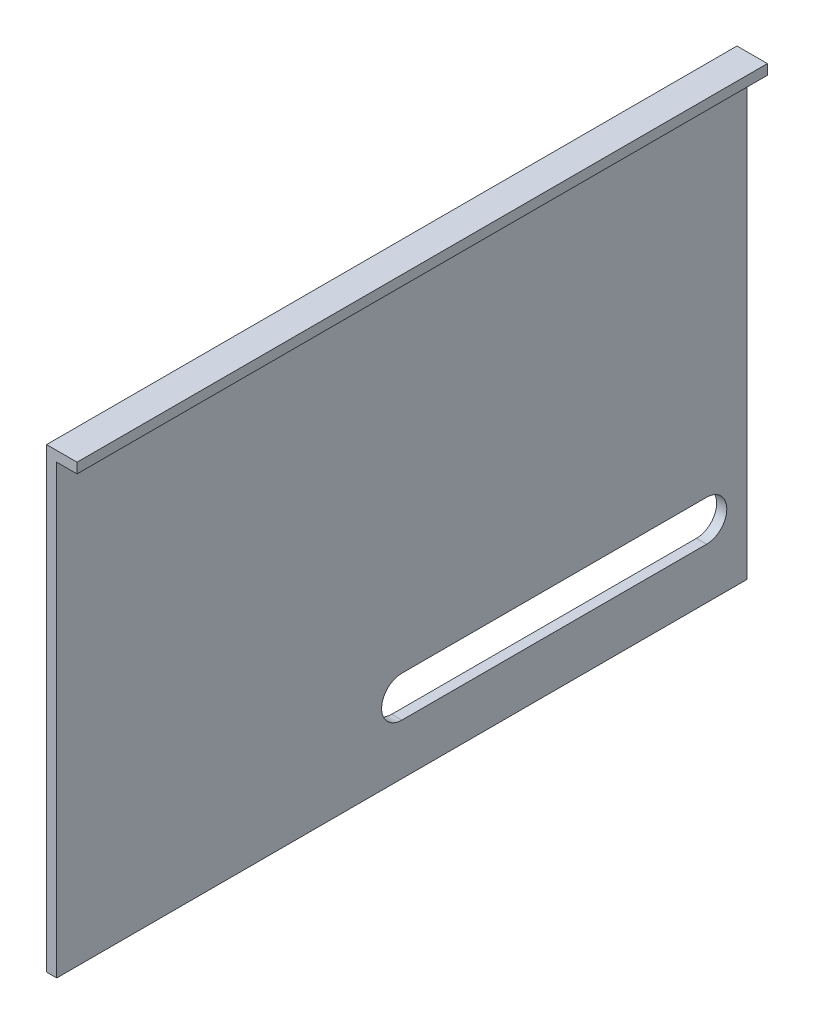
ISO-10303-21;
HEADER;
FILE_DESCRIPTION(('STEP AP214'),'2;1');
FILE_NAME('part.step','',(''),(''),'','','');
FILE_SCHEMA(('AUTOMOTIVE_DESIGN { 1 0 10303 214 1 1 1 1 }'));
ENDSEC;
DATA;
#1=APPLICATION_CONTEXT('core data for automotive mechanical design processes');
#2=APPLICATION_PROTOCOL_DEFINITION('international standard','automotive_design',2000,#1);
#3=PRODUCT_CONTEXT('',#1,'mechanical');
#4=PRODUCT('Part','Part','',(#3));
#5=PRODUCT_RELATED_PRODUCT_CATEGORY('part','',(#4));
#6=PRODUCT_DEFINITION_FORMATION('','',#4);
#7=PRODUCT_DEFINITION_CONTEXT('part definition',#1,'design');
#8=PRODUCT_DEFINITION('design','',#6,#7);
#9=PRODUCT_DEFINITION_SHAPE('','',#8);
#10=(LENGTH_UNIT() NAMED_UNIT(*) SI_UNIT(.MILLI.,.METRE.));
#11=(NAMED_UNIT(*) PLANE_ANGLE_UNIT() SI_UNIT($,.RADIAN.));
#12=(NAMED_UNIT(*) SI_UNIT($,.STERADIAN.) SOLID_ANGLE_UNIT());
#13=UNCERTAINTY_MEASURE_WITH_UNIT(LENGTH_MEASURE(1.E-05),#10,'distance_accuracy_value','');
#14=(GEOMETRIC_REPRESENTATION_CONTEXT(3) GLOBAL_UNCERTAINTY_ASSIGNED_CONTEXT((#13)) GLOBAL_UNIT_ASSIGNED_CONTEXT((#10,
#11,#12)) REPRESENTATION_CONTEXT('',''));
#15=CARTESIAN_POINT('',(0.,0.,0.));
#16=DIRECTION('',(0.,0.,1.));
#17=DIRECTION('',(1.,0.,0.));
#18=AXIS2_PLACEMENT_3D('',#15,#16,#17);
#19=CARTESIAN_POINT('',(6.35,142.875,215.9));
#20=DIRECTION('',(0.,0.,-1.));
#21=DIRECTION('',(-1.,0.,0.));
#22=AXIS2_PLACEMENT_3D('',#19,#20,#21);
#23=PLANE('',#22);
#24=DIRECTION('',(0.,-1.,0.));
#25=VECTOR('',#24,1.);
#26=CARTESIAN_POINT('',(0.,142.875,215.9));
#27=LINE('',#26,#25);
#28=CARTESIAN_POINT('',(0.,142.875,215.9));
#29=VERTEX_POINT('',#28);
#30=CARTESIAN_POINT('',(0.,-142.875,215.9));
#31=VERTEX_POINT('',#30);
#32=EDGE_CURVE('E168',#29,#31,#27,.T.);
#33=ORIENTED_EDGE('',*,*,#32,.T.);
#34=DIRECTION('',(-1.,0.,0.));
#35=VECTOR('',#34,1.);
#36=CARTESIAN_POINT('',(6.35,-142.875,215.9));
#37=LINE('',#36,#35);
#38=CARTESIAN_POINT('',(6.35,-142.875,215.9));
#39=VERTEX_POINT('',#38);
#40=EDGE_CURVE('E11',#39,#31,#37,.T.);
#41=ORIENTED_EDGE('',*,*,#40,.F.);
#42=DIRECTION('',(0.,-1.,0.));
#43=VECTOR('',#42,1.);
#44=CARTESIAN_POINT('',(6.35,142.875,215.9));
#45=LINE('',#44,#43);
#46=CARTESIAN_POINT('',(6.35,136.525,215.9));
#47=VERTEX_POINT('',#46);
#48=EDGE_CURVE('E169',#47,#39,#45,.T.);
#49=ORIENTED_EDGE('',*,*,#48,.F.);
#50=DIRECTION('',(-1.,0.,0.));
#51=VECTOR('',#50,1.);
#52=CARTESIAN_POINT('',(19.05,136.525,215.9));
#53=LINE('',#52,#51);
#54=CARTESIAN_POINT('',(19.05,136.525,215.9));
#55=VERTEX_POINT('',#54);
#56=EDGE_CURVE('E165',#55,#47,#53,.T.);
#57=ORIENTED_EDGE('',*,*,#56,.F.);
#58=DIRECTION('',(0.,-1.,0.));
#59=VECTOR('',#58,1.);
#60=CARTESIAN_POINT('',(19.05,142.875,215.9));
#61=LINE('',#60,#59);
#62=CARTESIAN_POINT('',(19.05,142.875,215.9));
#63=VERTEX_POINT('',#62);
#64=EDGE_CURVE('E149',#63,#55,#61,.T.);
#65=ORIENTED_EDGE('',*,*,#64,.F.);
#66=DIRECTION('',(-1.,0.,0.));
#67=VECTOR('',#66,1.);
#68=CARTESIAN_POINT('',(6.35,142.875,215.9));
#69=LINE('',#68,#67);
#70=EDGE_CURVE('E176',#63,#29,#69,.T.);
#71=ORIENTED_EDGE('',*,*,#70,.T.);
#72=EDGE_LOOP('',(#33,#41,#49,#57,#65,#71));
#73=FACE_BOUND('',#72,.T.);
#74=ADVANCED_FACE('F37',(#73),#23,.F.);
#75=CARTESIAN_POINT('',(6.35,-142.875,215.9));
#76=DIRECTION('',(0.,1.,0.));
#77=DIRECTION('',(0.,0.,1.));
#78=AXIS2_PLACEMENT_3D('',#75,#76,#77);
#79=PLANE('',#78);
#80=DIRECTION('',(0.,0.,-1.));
#81=VECTOR('',#80,1.);
#82=CARTESIAN_POINT('',(0.,-142.875,215.9));
#83=LINE('',#82,#81);
#84=CARTESIAN_POINT('',(0.,-142.875,-215.9));
#85=VERTEX_POINT('',#84);
#86=EDGE_CURVE('E179',#31,#85,#83,.T.);
#87=ORIENTED_EDGE('',*,*,#86,.T.);
#88=DIRECTION('',(-1.,0.,0.));
#89=VECTOR('',#88,1.);
#90=CARTESIAN_POINT('',(6.35,-142.875,-215.9));
#91=LINE('',#90,#89);
#92=CARTESIAN_POINT('',(6.35,-142.875,-215.9));
#93=VERTEX_POINT('',#92);
#94=EDGE_CURVE('E44',#93,#85,#91,.T.);
#95=ORIENTED_EDGE('',*,*,#94,.F.);
#96=DIRECTION('',(0.,0.,-1.));
#97=VECTOR('',#96,1.);
#98=CARTESIAN_POINT('',(6.35,-142.875,215.9));
#99=LINE('',#98,#97);
#100=EDGE_CURVE('E171',#39,#93,#99,.T.);
#101=ORIENTED_EDGE('',*,*,#100,.F.);
#102=ORIENTED_EDGE('',*,*,#40,.T.);
#103=EDGE_LOOP('',(#87,#95,#101,#102));
#104=FACE_BOUND('',#103,.T.);
#105=ADVANCED_FACE('F214',(#104),#79,.F.);
#106=CARTESIAN_POINT('',(6.35,142.875,-215.9));
#107=DIRECTION('',(0.,0.,1.));
#108=DIRECTION('',(0.,-1.,0.));
#109=AXIS2_PLACEMENT_3D('',#106,#107,#108);
#110=PLANE('',#109);
#111=DIRECTION('',(0.,1.,0.));
#112=VECTOR('',#111,1.);
#113=CARTESIAN_POINT('',(0.,142.875,-215.9));
#114=LINE('',#113,#112);
#115=CARTESIAN_POINT('',(0.,142.875,-215.9));
#116=VERTEX_POINT('',#115);
#117=EDGE_CURVE('E181',#85,#116,#114,.T.);
#118=ORIENTED_EDGE('',*,*,#117,.T.);
#119=DIRECTION('',(-1.,0.,0.));
#120=VECTOR('',#119,1.);
#121=CARTESIAN_POINT('',(6.35,142.875,-215.9));
#122=LINE('',#121,#120);
#123=CARTESIAN_POINT('',(19.05,142.875,-215.9));
#124=VERTEX_POINT('',#123);
#125=EDGE_CURVE('E186',#124,#116,#122,.T.);
#126=ORIENTED_EDGE('',*,*,#125,.F.);
#127=DIRECTION('',(0.,1.,0.));
#128=VECTOR('',#127,1.);
#129=CARTESIAN_POINT('',(19.05,142.875,-215.9));
#130=LINE('',#129,#128);
#131=CARTESIAN_POINT('',(19.05,136.525,-215.9));
#132=VERTEX_POINT('',#131);
#133=EDGE_CURVE('E154',#132,#124,#130,.T.);
#134=ORIENTED_EDGE('',*,*,#133,.F.);
#135=DIRECTION('',(-1.,0.,0.));
#136=VECTOR('',#135,1.);
#137=CARTESIAN_POINT('',(19.05,136.525,-215.9));
#138=LINE('',#137,#136);
#139=CARTESIAN_POINT('',(6.35,136.525,-215.9));
#140=VERTEX_POINT('',#139);
#141=EDGE_CURVE('E160',#132,#140,#138,.T.);
#142=ORIENTED_EDGE('',*,*,#141,.T.);
#143=DIRECTION('',(0.,1.,0.));
#144=VECTOR('',#143,1.);
#145=CARTESIAN_POINT('',(6.35,142.875,-215.9));
#146=LINE('',#145,#144);
#147=EDGE_CURVE('E174',#93,#140,#146,.T.);
#148=ORIENTED_EDGE('',*,*,#147,.F.);
#149=ORIENTED_EDGE('',*,*,#94,.T.);
#150=EDGE_LOOP('',(#118,#126,#134,#142,#148,#149));
#151=FACE_BOUND('',#150,.T.);
#152=ADVANCED_FACE('F193',(#151),#110,.F.);
#153=CARTESIAN_POINT('',(6.35,142.875,215.9));
#154=DIRECTION('',(0.,-1.,0.));
#155=DIRECTION('',(0.,0.,-1.));
#156=AXIS2_PLACEMENT_3D('',#153,#154,#155);
#157=PLANE('',#156);
#158=DIRECTION('',(0.,0.,1.));
#159=VECTOR('',#158,1.);
#160=CARTESIAN_POINT('',(0.,142.875,215.9));
#161=LINE('',#160,#159);
#162=EDGE_CURVE('E172',#116,#29,#161,.T.);
#163=ORIENTED_EDGE('',*,*,#162,.T.);
#164=ORIENTED_EDGE('',*,*,#70,.F.);
#165=DIRECTION('',(0.,0.,1.));
#166=VECTOR('',#165,1.);
#167=CARTESIAN_POINT('',(19.05,142.875,215.9));
#168=LINE('',#167,#166);
#169=EDGE_CURVE('E157',#124,#63,#168,.T.);
#170=ORIENTED_EDGE('',*,*,#169,.F.);
#171=ORIENTED_EDGE('',*,*,#125,.T.);
#172=EDGE_LOOP('',(#163,#164,#170,#171));
#173=FACE_BOUND('',#172,.T.);
#174=ADVANCED_FACE('F199',(#173),#157,.F.);
#175=CARTESIAN_POINT('',(6.35,0.,0.));
#176=DIRECTION('',(1.,0.,0.));
#177=DIRECTION('',(0.,0.,-1.));
#178=AXIS2_PLACEMENT_3D('',#175,#176,#177);
#179=PLANE('',#178);
#180=CARTESIAN_POINT('',(6.35,-98.425,-190.5));
#181=DIRECTION('',(1.,0.,0.));
#182=DIRECTION('',(0.,0.,-1.));
#183=AXIS2_PLACEMENT_3D('',#180,#181,#182);
#184=CIRCLE('',#183,12.7);
#185=CARTESIAN_POINT('',(6.35,-111.125,-190.5));
#186=VERTEX_POINT('',#185);
#187=CARTESIAN_POINT('',(6.35,-85.725,-190.5));
#188=VERTEX_POINT('',#187);
#189=EDGE_CURVE('E146',#186,#188,#184,.T.);
#190=ORIENTED_EDGE('',*,*,#189,.F.);
#191=DIRECTION('',(0.,0.,-1.));
#192=VECTOR('',#191,1.);
#193=CARTESIAN_POINT('',(6.35,-111.125,0.));
#194=LINE('',#193,#192);
#195=CARTESIAN_POINT('',(6.35,-111.125,0.));
#196=VERTEX_POINT('',#195);
#197=EDGE_CURVE('E139',#196,#186,#194,.T.);
#198=ORIENTED_EDGE('',*,*,#197,.F.);
#199=CARTESIAN_POINT('',(6.35,-98.425,0.));
#200=DIRECTION('',(1.,0.,0.));
#201=DIRECTION('',(0.,0.,-1.));
#202=AXIS2_PLACEMENT_3D('',#199,#200,#201);
#203=CIRCLE('',#202,12.7);
#204=CARTESIAN_POINT('',(6.35,-85.725,0.));
#205=VERTEX_POINT('',#204);
#206=EDGE_CURVE('E119',#205,#196,#203,.T.);
#207=ORIENTED_EDGE('',*,*,#206,.F.);
#208=DIRECTION('',(0.,0.,1.));
#209=VECTOR('',#208,1.);
#210=CARTESIAN_POINT('',(6.35,-85.725,0.));
#211=LINE('',#210,#209);
#212=EDGE_CURVE('E144',#188,#205,#211,.T.);
#213=ORIENTED_EDGE('',*,*,#212,.F.);
#214=EDGE_LOOP('',(#190,#198,#207,#213));
#215=FACE_BOUND('',#214,.T.);
#216=DIRECTION('',(0.,0.,-1.));
#217=VECTOR('',#216,1.);
#218=CARTESIAN_POINT('',(6.35,136.525,215.9));
#219=LINE('',#218,#217);
#220=EDGE_CURVE('E148',#47,#140,#219,.T.);
#221=ORIENTED_EDGE('',*,*,#220,.F.);
#222=ORIENTED_EDGE('',*,*,#48,.T.);
#223=ORIENTED_EDGE('',*,*,#100,.T.);
#224=ORIENTED_EDGE('',*,*,#147,.T.);
#225=EDGE_LOOP('',(#221,#222,#223,#224));
#226=FACE_BOUND('',#225,.T.);
#227=ADVANCED_FACE('F213',(#215,#226),#179,.T.);
#228=CARTESIAN_POINT('',(0.,0.,0.));
#229=DIRECTION('',(1.,0.,0.));
#230=DIRECTION('',(0.,0.,-1.));
#231=AXIS2_PLACEMENT_3D('',#228,#229,#230);
#232=PLANE('',#231);
#233=DIRECTION('',(0.,0.,1.));
#234=VECTOR('',#233,1.);
#235=CARTESIAN_POINT('',(0.,-111.125,0.));
#236=LINE('',#235,#234);
#237=CARTESIAN_POINT('',(0.,-111.125,-190.5));
#238=VERTEX_POINT('',#237);
#239=CARTESIAN_POINT('',(0.,-111.125,0.));
#240=VERTEX_POINT('',#239);
#241=EDGE_CURVE('E125',#238,#240,#236,.T.);
#242=ORIENTED_EDGE('',*,*,#241,.F.);
#243=CARTESIAN_POINT('',(0.,-98.425,-190.5));
#244=DIRECTION('',(-1.,0.,0.));
#245=DIRECTION('',(0.,0.,-1.));
#246=AXIS2_PLACEMENT_3D('',#243,#244,#245);
#247=CIRCLE('',#246,12.7);
#248=CARTESIAN_POINT('',(0.,-85.725,-190.5));
#249=VERTEX_POINT('',#248);
#250=EDGE_CURVE('E59',#249,#238,#247,.T.);
#251=ORIENTED_EDGE('',*,*,#250,.F.);
#252=DIRECTION('',(0.,0.,-1.));
#253=VECTOR('',#252,1.);
#254=CARTESIAN_POINT('',(0.,-85.725,-190.5));
#255=LINE('',#254,#253);
#256=CARTESIAN_POINT('',(0.,-85.725,0.));
#257=VERTEX_POINT('',#256);
#258=EDGE_CURVE('E132',#257,#249,#255,.T.);
#259=ORIENTED_EDGE('',*,*,#258,.F.);
#260=CARTESIAN_POINT('',(0.,-98.425,0.));
#261=DIRECTION('',(-1.,0.,0.));
#262=DIRECTION('',(0.,0.,-1.));
#263=AXIS2_PLACEMENT_3D('',#260,#261,#262);
#264=CIRCLE('',#263,12.7);
#265=EDGE_CURVE('E116',#240,#257,#264,.T.);
#266=ORIENTED_EDGE('',*,*,#265,.F.);
#267=EDGE_LOOP('',(#242,#251,#259,#266));
#268=FACE_BOUND('',#267,.T.);
#269=ORIENTED_EDGE('',*,*,#32,.F.);
#270=ORIENTED_EDGE('',*,*,#162,.F.);
#271=ORIENTED_EDGE('',*,*,#117,.F.);
#272=ORIENTED_EDGE('',*,*,#86,.F.);
#273=EDGE_LOOP('',(#269,#270,#271,#272));
#274=FACE_BOUND('',#273,.T.);
#275=ADVANCED_FACE('F129',(#268,#274),#232,.F.);
#276=CARTESIAN_POINT('',(19.05,136.525,215.9));
#277=DIRECTION('',(0.,1.,0.));
#278=DIRECTION('',(0.,0.,1.));
#279=AXIS2_PLACEMENT_3D('',#276,#277,#278);
#280=PLANE('',#279);
#281=ORIENTED_EDGE('',*,*,#220,.T.);
#282=ORIENTED_EDGE('',*,*,#141,.F.);
#283=DIRECTION('',(0.,0.,-1.));
#284=VECTOR('',#283,1.);
#285=CARTESIAN_POINT('',(19.05,136.525,215.9));
#286=LINE('',#285,#284);
#287=EDGE_CURVE('E152',#55,#132,#286,.T.);
#288=ORIENTED_EDGE('',*,*,#287,.F.);
#289=ORIENTED_EDGE('',*,*,#56,.T.);
#290=EDGE_LOOP('',(#281,#282,#288,#289));
#291=FACE_BOUND('',#290,.T.);
#292=ADVANCED_FACE('F211',(#291),#280,.F.);
#293=CARTESIAN_POINT('',(19.05,0.,0.));
#294=DIRECTION('',(1.,0.,0.));
#295=DIRECTION('',(0.,0.,-1.));
#296=AXIS2_PLACEMENT_3D('',#293,#294,#295);
#297=PLANE('',#296);
#298=ORIENTED_EDGE('',*,*,#64,.T.);
#299=ORIENTED_EDGE('',*,*,#287,.T.);
#300=ORIENTED_EDGE('',*,*,#133,.T.);
#301=ORIENTED_EDGE('',*,*,#169,.T.);
#302=EDGE_LOOP('',(#298,#299,#300,#301));
#303=FACE_BOUND('',#302,.T.);
#304=ADVANCED_FACE('F207',(#303),#297,.T.);
#305=CARTESIAN_POINT('',(19.05,-98.425,-190.5));
#306=DIRECTION('',(-1.,0.,0.));
#307=DIRECTION('',(0.,0.,1.));
#308=AXIS2_PLACEMENT_3D('',#305,#306,#307);
#309=CYLINDRICAL_SURFACE('',#308,12.7);
#310=ORIENTED_EDGE('',*,*,#189,.T.);
#311=DIRECTION('',(-1.,0.,0.));
#312=VECTOR('',#311,1.);
#313=CARTESIAN_POINT('',(19.05,-85.725,-190.5));
#314=LINE('',#313,#312);
#315=EDGE_CURVE('E137',#188,#249,#314,.T.);
#316=ORIENTED_EDGE('',*,*,#315,.T.);
#317=ORIENTED_EDGE('',*,*,#250,.T.);
#318=DIRECTION('',(-1.,0.,0.));
#319=VECTOR('',#318,1.);
#320=CARTESIAN_POINT('',(19.05,-111.125,-190.5));
#321=LINE('',#320,#319);
#322=EDGE_CURVE('E122',#186,#238,#321,.T.);
#323=ORIENTED_EDGE('',*,*,#322,.F.);
#324=EDGE_LOOP('',(#310,#316,#317,#323));
#325=FACE_BOUND('',#324,.T.);
#326=ADVANCED_FACE('F233',(#325),#309,.F.);
#327=CARTESIAN_POINT('',(19.05,-85.725,-190.5));
#328=DIRECTION('',(0.,1.,0.));
#329=DIRECTION('',(0.,0.,1.));
#330=AXIS2_PLACEMENT_3D('',#327,#328,#329);
#331=PLANE('',#330);
#332=ORIENTED_EDGE('',*,*,#212,.T.);
#333=DIRECTION('',(-1.,0.,0.));
#334=VECTOR('',#333,1.);
#335=CARTESIAN_POINT('',(19.05,-85.725,0.));
#336=LINE('',#335,#334);
#337=EDGE_CURVE('E121',#205,#257,#336,.T.);
#338=ORIENTED_EDGE('',*,*,#337,.T.);
#339=ORIENTED_EDGE('',*,*,#258,.T.);
#340=ORIENTED_EDGE('',*,*,#315,.F.);
#341=EDGE_LOOP('',(#332,#338,#339,#340));
#342=FACE_BOUND('',#341,.T.);
#343=ADVANCED_FACE('F236',(#342),#331,.F.);
#344=CARTESIAN_POINT('',(19.05,-98.425,0.));
#345=DIRECTION('',(-1.,0.,0.));
#346=DIRECTION('',(0.,0.,1.));
#347=AXIS2_PLACEMENT_3D('',#344,#345,#346);
#348=CYLINDRICAL_SURFACE('',#347,12.7);
#349=ORIENTED_EDGE('',*,*,#206,.T.);
#350=DIRECTION('',(-1.,0.,0.));
#351=VECTOR('',#350,1.);
#352=CARTESIAN_POINT('',(19.05,-111.125,0.));
#353=LINE('',#352,#351);
#354=EDGE_CURVE('E51',#196,#240,#353,.T.);
#355=ORIENTED_EDGE('',*,*,#354,.T.);
#356=ORIENTED_EDGE('',*,*,#265,.T.);
#357=ORIENTED_EDGE('',*,*,#337,.F.);
#358=EDGE_LOOP('',(#349,#355,#356,#357));
#359=FACE_BOUND('',#358,.T.);
#360=ADVANCED_FACE('F113',(#359),#348,.F.);
#361=CARTESIAN_POINT('',(19.05,-111.125,0.));
#362=DIRECTION('',(0.,-1.,0.));
#363=DIRECTION('',(0.,0.,-1.));
#364=AXIS2_PLACEMENT_3D('',#361,#362,#363);
#365=PLANE('',#364);
#366=ORIENTED_EDGE('',*,*,#197,.T.);
#367=ORIENTED_EDGE('',*,*,#322,.T.);
#368=ORIENTED_EDGE('',*,*,#241,.T.);
#369=ORIENTED_EDGE('',*,*,#354,.F.);
#370=EDGE_LOOP('',(#366,#367,#368,#369));
#371=FACE_BOUND('',#370,.T.);
#372=ADVANCED_FACE('F126',(#371),#365,.F.);
#373=CLOSED_SHELL('',(#74,#105,#152,#174,#227,#275,#292,#304,#326,#343,#360,#372));
#374=MANIFOLD_SOLID_BREP('B2',#373);
#375=ADVANCED_BREP_SHAPE_REPRESENTATION('',(#18,#374),#14);
#376=SHAPE_DEFINITION_REPRESENTATION(#9,#375);
ENDSEC;
END-ISO-10303-21;
